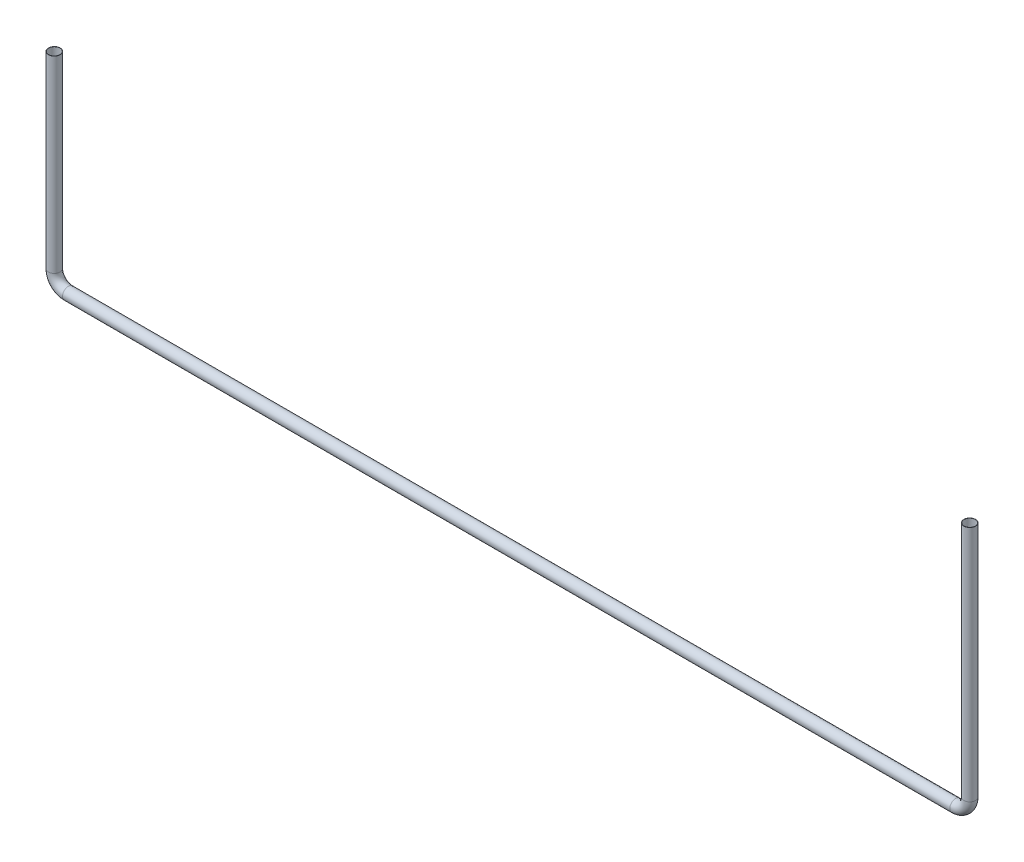
ISO-10303-21;
HEADER;
FILE_DESCRIPTION(('STEP AP214'),'2;1');
FILE_NAME('part.step','',(''),(''),'','','');
FILE_SCHEMA(('AUTOMOTIVE_DESIGN { 1 0 10303 214 1 1 1 1 }'));
ENDSEC;
DATA;
#1=APPLICATION_CONTEXT('core data for automotive mechanical design processes');
#2=APPLICATION_PROTOCOL_DEFINITION('international standard','automotive_design',2000,#1);
#3=PRODUCT_CONTEXT('',#1,'mechanical');
#4=PRODUCT('Part','Part','',(#3));
#5=PRODUCT_RELATED_PRODUCT_CATEGORY('part','',(#4));
#6=PRODUCT_DEFINITION_FORMATION('','',#4);
#7=PRODUCT_DEFINITION_CONTEXT('part definition',#1,'design');
#8=PRODUCT_DEFINITION('design','',#6,#7);
#9=PRODUCT_DEFINITION_SHAPE('','',#8);
#10=(LENGTH_UNIT() NAMED_UNIT(*) SI_UNIT(.MILLI.,.METRE.));
#11=(NAMED_UNIT(*) PLANE_ANGLE_UNIT() SI_UNIT($,.RADIAN.));
#12=(NAMED_UNIT(*) SI_UNIT($,.STERADIAN.) SOLID_ANGLE_UNIT());
#13=UNCERTAINTY_MEASURE_WITH_UNIT(LENGTH_MEASURE(1.E-05),#10,'distance_accuracy_value','');
#14=(GEOMETRIC_REPRESENTATION_CONTEXT(3) GLOBAL_UNCERTAINTY_ASSIGNED_CONTEXT((#13)) GLOBAL_UNIT_ASSIGNED_CONTEXT((#10,
#11,#12)) REPRESENTATION_CONTEXT('',''));
#15=CARTESIAN_POINT('',(0.,0.,0.));
#16=DIRECTION('',(0.,0.,1.));
#17=DIRECTION('',(1.,0.,0.));
#18=AXIS2_PLACEMENT_3D('',#15,#16,#17);
#19=CARTESIAN_POINT('',(-38227.5389894421,-16467.0513516881,42621.7001960568));
#20=DIRECTION('',(0.,1.,0.));
#21=DIRECTION('',(0.,0.,-1.));
#22=AXIS2_PLACEMENT_3D('',#19,#20,#21);
#23=PLANE('',#22);
#24=CARTESIAN_POINT('',(-38227.5389894421,-16467.0513516881,42621.7001960568));
#25=DIRECTION('',(0.,1.,0.));
#26=DIRECTION('',(0.,0.,1.));
#27=AXIS2_PLACEMENT_3D('',#24,#25,#26);
#28=CIRCLE('',#27,23.9999999999986);
#29=CARTESIAN_POINT('',(-38227.5389894421,-16467.0513516881,42645.7001960568));
#30=VERTEX_POINT('',#29);
#31=EDGE_CURVE('E76',#30,#30,#28,.T.);
#32=ORIENTED_EDGE('',*,*,#31,.F.);
#33=EDGE_LOOP('',(#32));
#34=FACE_BOUND('',#33,.T.);
#35=CARTESIAN_POINT('',(-38227.5389894421,-16467.0513516881,42621.7001960568));
#36=DIRECTION('',(0.,1.,0.));
#37=DIRECTION('',(0.,0.,-1.));
#38=AXIS2_PLACEMENT_3D('',#35,#36,#37);
#39=CIRCLE('',#38,24.9999999999986);
#40=CARTESIAN_POINT('',(-38227.5389894421,-16467.0513516881,42596.7001960568));
#41=VERTEX_POINT('',#40);
#42=EDGE_CURVE('E69',#41,#41,#39,.T.);
#43=ORIENTED_EDGE('',*,*,#42,.T.);
#44=EDGE_LOOP('',(#43));
#45=FACE_BOUND('',#44,.T.);
#46=ADVANCED_FACE('F47',(#34,#45),#23,.T.);
#47=CARTESIAN_POINT('',(-34329.4007758843,-16256.6264217411,42621.7001960568));
#48=DIRECTION('',(0.,-1.,0.));
#49=DIRECTION('',(0.,0.,-1.));
#50=AXIS2_PLACEMENT_3D('',#47,#48,#49);
#51=PLANE('',#50);
#52=CARTESIAN_POINT('',(-34329.4007758843,-16256.6264217411,42621.7001960568));
#53=DIRECTION('',(0.,-1.,0.));
#54=DIRECTION('',(0.,0.,-1.));
#55=AXIS2_PLACEMENT_3D('',#52,#53,#54);
#56=CIRCLE('',#55,23.9999999999986);
#57=CARTESIAN_POINT('',(-34329.4007758843,-16256.6264217411,42597.7001960568));
#58=VERTEX_POINT('',#57);
#59=EDGE_CURVE('E72',#58,#58,#56,.T.);
#60=ORIENTED_EDGE('',*,*,#59,.T.);
#61=EDGE_LOOP('',(#60));
#62=FACE_BOUND('',#61,.T.);
#63=CARTESIAN_POINT('',(-34329.4007758843,-16256.6264217411,42621.7001960568));
#64=DIRECTION('',(0.,-1.,0.));
#65=DIRECTION('',(0.,0.,-1.));
#66=AXIS2_PLACEMENT_3D('',#63,#64,#65);
#67=CIRCLE('',#66,24.9999999999986);
#68=CARTESIAN_POINT('',(-34329.4007758843,-16256.6264217411,42596.7001960568));
#69=VERTEX_POINT('',#68);
#70=EDGE_CURVE('E11',#69,#69,#67,.T.);
#71=ORIENTED_EDGE('',*,*,#70,.F.);
#72=EDGE_LOOP('',(#71));
#73=FACE_BOUND('',#72,.T.);
#74=ADVANCED_FACE('F102',(#62,#73),#51,.F.);
#75=CARTESIAN_POINT('',(-38227.5389894421,-16467.0513516881,42621.7001960568));
#76=DIRECTION('',(0.,-1.,0.));
#77=DIRECTION('',(0.,0.,-1.));
#78=AXIS2_PLACEMENT_3D('',#75,#76,#77);
#79=CYLINDRICAL_SURFACE('',#78,24.9999999999986);
#80=CARTESIAN_POINT('',(-38227.5389894421,-17268.4637375335,42621.7001960568));
#81=DIRECTION('',(0.,1.,0.));
#82=DIRECTION('',(0.,0.,-1.));
#83=AXIS2_PLACEMENT_3D('',#80,#81,#82);
#84=CIRCLE('',#83,24.9999999999986);
#85=CARTESIAN_POINT('',(-38252.5389894421,-17268.4637375335,42621.7001960568));
#86=VERTEX_POINT('',#85);
#87=EDGE_CURVE('E66',#86,#86,#84,.T.);
#88=ORIENTED_EDGE('',*,*,#87,.T.);
#89=EDGE_LOOP('',(#88));
#90=FACE_BOUND('',#89,.T.);
#91=ORIENTED_EDGE('',*,*,#42,.F.);
#92=EDGE_LOOP('',(#91));
#93=FACE_BOUND('',#92,.T.);
#94=ADVANCED_FACE('F106',(#90,#93),#79,.T.);
#95=CARTESIAN_POINT('',(-38167.5389894421,-17268.4637375335,42621.7001960568));
#96=DIRECTION('',(0.,0.,1.));
#97=DIRECTION('',(1.,0.,0.));
#98=AXIS2_PLACEMENT_3D('',#95,#96,#97);
#99=TOROIDAL_SURFACE('',#98,59.9999999999952,24.9999999999986);
#100=CARTESIAN_POINT('',(-38167.5389894421,-17328.4637375335,42621.7001960568));
#101=DIRECTION('',(-1.,1.18423789293346E-13,0.));
#102=DIRECTION('',(0.,0.,-1.));
#103=AXIS2_PLACEMENT_3D('',#100,#101,#102);
#104=CIRCLE('',#103,24.9999999999986);
#105=CARTESIAN_POINT('',(-38167.5389894421,-17353.4637375335,42621.7001960568));
#106=VERTEX_POINT('',#105);
#107=EDGE_CURVE('E61',#106,#106,#104,.T.);
#108=CARTESIAN_POINT('',(-38167.5389894421,-17268.4637375335,42621.7001960568));
#109=DIRECTION('',(0.,0.,1.));
#110=DIRECTION('',(1.,0.,0.));
#111=AXIS2_PLACEMENT_3D('',#108,#109,#110);
#112=CIRCLE('',#111,84.9999999999937);
#113=EDGE_CURVE('',#86,#106,#112,.T.);
#114=ORIENTED_EDGE('',*,*,#87,.F.);
#115=ORIENTED_EDGE('',*,*,#107,.T.);
#116=ORIENTED_EDGE('',*,*,#113,.T.);
#117=ORIENTED_EDGE('',*,*,#113,.F.);
#118=EDGE_LOOP('',(#114,#116,#115,#117));
#119=FACE_BOUND('',#118,.T.);
#120=ADVANCED_FACE('F108',(#119),#99,.T.);
#121=CARTESIAN_POINT('',(-38167.5389894421,-17328.4637375335,42621.7001960568));
#122=DIRECTION('',(1.,0.,0.));
#123=DIRECTION('',(0.,0.,-1.));
#124=AXIS2_PLACEMENT_3D('',#121,#122,#123);
#125=CYLINDRICAL_SURFACE('',#124,24.9999999999986);
#126=CARTESIAN_POINT('',(-34389.4007758843,-17328.4637375335,42621.7001960568));
#127=DIRECTION('',(-1.,0.,0.));
#128=DIRECTION('',(0.,0.,-1.));
#129=AXIS2_PLACEMENT_3D('',#126,#127,#128);
#130=CIRCLE('',#129,24.9999999999986);
#131=CARTESIAN_POINT('',(-34389.4007758843,-17353.4637375336,42621.7001960568));
#132=VERTEX_POINT('',#131);
#133=EDGE_CURVE('E57',#132,#132,#130,.T.);
#134=ORIENTED_EDGE('',*,*,#133,.T.);
#135=EDGE_LOOP('',(#134));
#136=FACE_BOUND('',#135,.T.);
#137=ORIENTED_EDGE('',*,*,#107,.F.);
#138=EDGE_LOOP('',(#137));
#139=FACE_BOUND('',#138,.T.);
#140=ADVANCED_FACE('F115',(#136,#139),#125,.T.);
#141=CARTESIAN_POINT('',(-34389.4007758843,-17268.4637375336,42621.7001960568));
#142=DIRECTION('',(0.,0.,1.));
#143=DIRECTION('',(1.,0.,0.));
#144=AXIS2_PLACEMENT_3D('',#141,#142,#143);
#145=TOROIDAL_SURFACE('',#144,60.0000000000023,24.9999999999986);
#146=CARTESIAN_POINT('',(-34329.4007758843,-17268.4637375333,42621.7001960569));
#147=DIRECTION('',(0.,-1.,0.));
#148=DIRECTION('',(0.,0.,-1.));
#149=AXIS2_PLACEMENT_3D('',#146,#147,#148);
#150=CIRCLE('',#149,24.9999999999986);
#151=CARTESIAN_POINT('',(-34304.4007758843,-17268.4637375331,42621.700196057));
#152=VERTEX_POINT('',#151);
#153=EDGE_CURVE('E53',#152,#152,#150,.T.);
#154=CARTESIAN_POINT('',(-34389.4007758843,-17268.4637375336,42621.7001960568));
#155=DIRECTION('',(0.,0.,1.));
#156=DIRECTION('',(1.,0.,0.));
#157=AXIS2_PLACEMENT_3D('',#154,#155,#156);
#158=CIRCLE('',#157,85.0000000000009);
#159=EDGE_CURVE('',#132,#152,#158,.T.);
#160=ORIENTED_EDGE('',*,*,#133,.F.);
#161=ORIENTED_EDGE('',*,*,#153,.T.);
#162=ORIENTED_EDGE('',*,*,#159,.T.);
#163=ORIENTED_EDGE('',*,*,#159,.F.);
#164=EDGE_LOOP('',(#160,#162,#161,#163));
#165=FACE_BOUND('',#164,.T.);
#166=ADVANCED_FACE('F121',(#165),#145,.T.);
#167=CARTESIAN_POINT('',(-34329.4007758843,-17268.4637375336,42621.7001960568));
#168=DIRECTION('',(0.,1.,0.));
#169=DIRECTION('',(0.,0.,1.));
#170=AXIS2_PLACEMENT_3D('',#167,#168,#169);
#171=CYLINDRICAL_SURFACE('',#170,24.9999999999986);
#172=ORIENTED_EDGE('',*,*,#70,.T.);
#173=EDGE_LOOP('',(#172));
#174=FACE_BOUND('',#173,.T.);
#175=ORIENTED_EDGE('',*,*,#153,.F.);
#176=EDGE_LOOP('',(#175));
#177=FACE_BOUND('',#176,.T.);
#178=ADVANCED_FACE('F96',(#174,#177),#171,.T.);
#179=CARTESIAN_POINT('',(-38227.5389894421,-16467.0513516881,42621.7001960568));
#180=DIRECTION('',(0.,-1.,0.));
#181=DIRECTION('',(0.,0.,-1.));
#182=AXIS2_PLACEMENT_3D('',#179,#180,#181);
#183=CYLINDRICAL_SURFACE('',#182,23.9999999999986);
#184=CARTESIAN_POINT('',(-38227.5389894421,-17268.4637375335,42621.7001960568));
#185=DIRECTION('',(0.,-1.,0.));
#186=DIRECTION('',(0.,0.,-1.));
#187=AXIS2_PLACEMENT_3D('',#184,#185,#186);
#188=CIRCLE('',#187,23.9999999999986);
#189=CARTESIAN_POINT('',(-38251.5389894421,-17268.4637375335,42621.7001960568));
#190=VERTEX_POINT('',#189);
#191=EDGE_CURVE('E79',#190,#190,#188,.F.);
#192=ORIENTED_EDGE('',*,*,#191,.F.);
#193=EDGE_LOOP('',(#192));
#194=FACE_BOUND('',#193,.T.);
#195=ORIENTED_EDGE('',*,*,#31,.T.);
#196=EDGE_LOOP('',(#195));
#197=FACE_BOUND('',#196,.T.);
#198=ADVANCED_FACE('F93',(#194,#197),#183,.F.);
#199=CARTESIAN_POINT('',(-38167.5389894421,-17268.4637375335,42621.7001960568));
#200=DIRECTION('',(0.,0.,1.));
#201=DIRECTION('',(1.,0.,0.));
#202=AXIS2_PLACEMENT_3D('',#199,#200,#201);
#203=TOROIDAL_SURFACE('',#202,59.9999999999952,23.9999999999986);
#204=CARTESIAN_POINT('',(-38167.5389894421,-17328.4637375335,42621.7001960568));
#205=DIRECTION('',(-1.,1.19199605259689E-13,0.));
#206=DIRECTION('',(-1.19199605259689E-13,-1.,0.));
#207=AXIS2_PLACEMENT_3D('',#204,#205,#206);
#208=CIRCLE('',#207,23.9999999999986);
#209=CARTESIAN_POINT('',(-38167.5389894421,-17352.4637375335,42621.7001960568));
#210=VERTEX_POINT('',#209);
#211=EDGE_CURVE('E85',#210,#210,#208,.T.);
#212=CARTESIAN_POINT('',(-38167.5389894421,-17268.4637375335,42621.7001960568));
#213=DIRECTION('',(0.,0.,1.));
#214=DIRECTION('',(1.,0.,0.));
#215=AXIS2_PLACEMENT_3D('',#212,#213,#214);
#216=CIRCLE('',#215,83.9999999999937);
#217=EDGE_CURVE('',#190,#210,#216,.T.);
#218=ORIENTED_EDGE('',*,*,#191,.T.);
#219=ORIENTED_EDGE('',*,*,#211,.F.);
#220=ORIENTED_EDGE('',*,*,#217,.T.);
#221=ORIENTED_EDGE('',*,*,#217,.F.);
#222=EDGE_LOOP('',(#218,#220,#219,#221));
#223=FACE_BOUND('',#222,.T.);
#224=ADVANCED_FACE('F91',(#223),#203,.F.);
#225=CARTESIAN_POINT('',(-38167.5389894421,-17328.4637375335,42621.7001960568));
#226=DIRECTION('',(1.,0.,0.));
#227=DIRECTION('',(0.,0.,-1.));
#228=AXIS2_PLACEMENT_3D('',#225,#226,#227);
#229=CYLINDRICAL_SURFACE('',#228,23.9999999999986);
#230=CARTESIAN_POINT('',(-34389.4007758843,-17328.4637375336,42621.7001960568));
#231=DIRECTION('',(1.,0.,0.));
#232=DIRECTION('',(0.,0.,-1.));
#233=AXIS2_PLACEMENT_3D('',#230,#231,#232);
#234=CIRCLE('',#233,23.9999999999986);
#235=CARTESIAN_POINT('',(-34389.4007758843,-17352.4637375336,42621.7001960568));
#236=VERTEX_POINT('',#235);
#237=EDGE_CURVE('E82',#236,#236,#234,.F.);
#238=ORIENTED_EDGE('',*,*,#237,.F.);
#239=EDGE_LOOP('',(#238));
#240=FACE_BOUND('',#239,.T.);
#241=ORIENTED_EDGE('',*,*,#211,.T.);
#242=EDGE_LOOP('',(#241));
#243=FACE_BOUND('',#242,.T.);
#244=ADVANCED_FACE('F167',(#240,#243),#229,.F.);
#245=CARTESIAN_POINT('',(-34389.4007758843,-17268.4637375336,42621.7001960568));
#246=DIRECTION('',(0.,0.,1.));
#247=DIRECTION('',(1.,0.,0.));
#248=AXIS2_PLACEMENT_3D('',#245,#246,#247);
#249=TOROIDAL_SURFACE('',#248,60.0000000000023,23.9999999999986);
#250=CARTESIAN_POINT('',(-34329.4007758843,-17268.4637375333,42621.7001960568));
#251=DIRECTION('',(4.97379915032051E-12,-1.,0.));
#252=DIRECTION('',(1.,4.97379915032051E-12,0.));
#253=AXIS2_PLACEMENT_3D('',#250,#251,#252);
#254=CIRCLE('',#253,23.9999999999986);
#255=CARTESIAN_POINT('',(-34305.4007758843,-17268.4637375331,42621.7001960568));
#256=VERTEX_POINT('',#255);
#257=EDGE_CURVE('E75',#256,#256,#254,.T.);
#258=CARTESIAN_POINT('',(-34389.4007758843,-17268.4637375336,42621.7001960568));
#259=DIRECTION('',(0.,0.,1.));
#260=DIRECTION('',(1.,0.,0.));
#261=AXIS2_PLACEMENT_3D('',#258,#259,#260);
#262=CIRCLE('',#261,84.0000000000009);
#263=EDGE_CURVE('',#236,#256,#262,.T.);
#264=ORIENTED_EDGE('',*,*,#237,.T.);
#265=ORIENTED_EDGE('',*,*,#257,.F.);
#266=ORIENTED_EDGE('',*,*,#263,.T.);
#267=ORIENTED_EDGE('',*,*,#263,.F.);
#268=EDGE_LOOP('',(#264,#266,#265,#267));
#269=FACE_BOUND('',#268,.T.);
#270=ADVANCED_FACE('F178',(#269),#249,.F.);
#271=CARTESIAN_POINT('',(-34329.4007758843,-17268.4637375336,42621.7001960568));
#272=DIRECTION('',(0.,1.,0.));
#273=DIRECTION('',(0.,0.,1.));
#274=AXIS2_PLACEMENT_3D('',#271,#272,#273);
#275=CYLINDRICAL_SURFACE('',#274,23.9999999999986);
#276=ORIENTED_EDGE('',*,*,#59,.F.);
#277=EDGE_LOOP('',(#276));
#278=FACE_BOUND('',#277,.T.);
#279=ORIENTED_EDGE('',*,*,#257,.T.);
#280=EDGE_LOOP('',(#279));
#281=FACE_BOUND('',#280,.T.);
#282=ADVANCED_FACE('F103',(#278,#281),#275,.F.);
#283=CLOSED_SHELL('',(#46,#74,#94,#120,#140,#166,#178,#198,#224,#244,#270,#282));
#284=MANIFOLD_SOLID_BREP('B2',#283);
#285=ADVANCED_BREP_SHAPE_REPRESENTATION('',(#18,#284),#14);
#286=SHAPE_DEFINITION_REPRESENTATION(#9,#285);
ENDSEC;
END-ISO-10303-21;
